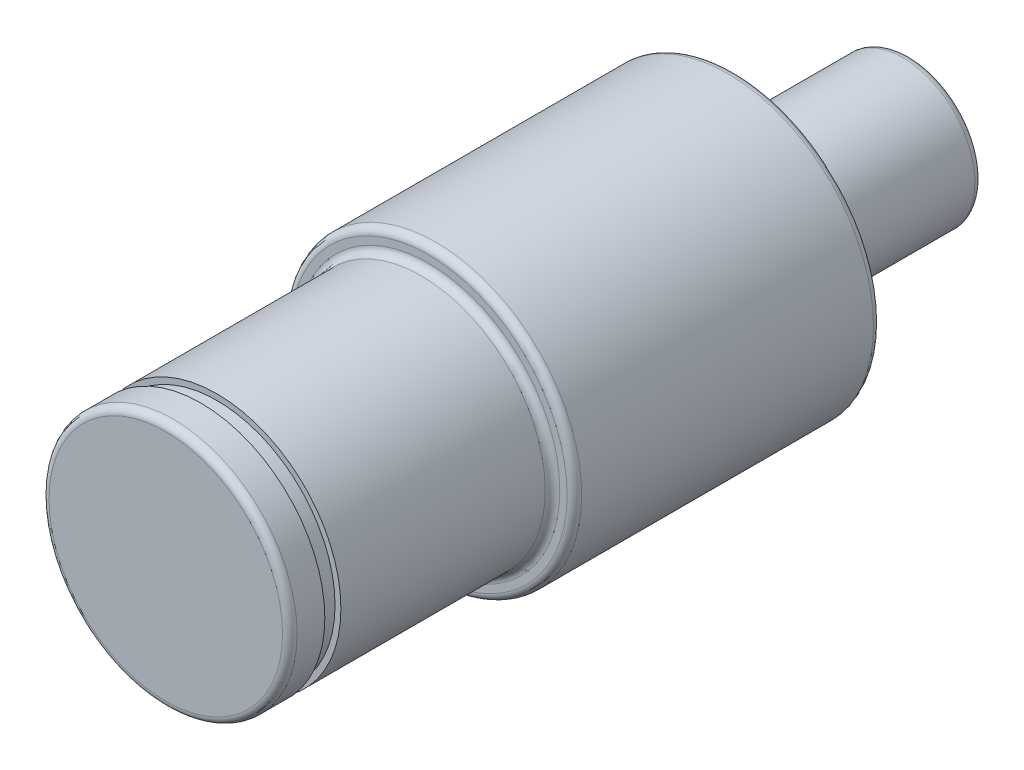
ISO-10303-21;
HEADER;
FILE_DESCRIPTION(('STEP AP214'),'2;1');
FILE_NAME('part.step','',(''),(''),'','','');
FILE_SCHEMA(('AUTOMOTIVE_DESIGN { 1 0 10303 214 1 1 1 1 }'));
ENDSEC;
DATA;
#1=APPLICATION_CONTEXT('core data for automotive mechanical design processes');
#2=APPLICATION_PROTOCOL_DEFINITION('international standard','automotive_design',2000,#1);
#3=PRODUCT_CONTEXT('',#1,'mechanical');
#4=PRODUCT('Part','Part','',(#3));
#5=PRODUCT_RELATED_PRODUCT_CATEGORY('part','',(#4));
#6=PRODUCT_DEFINITION_FORMATION('','',#4);
#7=PRODUCT_DEFINITION_CONTEXT('part definition',#1,'design');
#8=PRODUCT_DEFINITION('design','',#6,#7);
#9=PRODUCT_DEFINITION_SHAPE('','',#8);
#10=(LENGTH_UNIT() NAMED_UNIT(*) SI_UNIT(.MILLI.,.METRE.));
#11=(NAMED_UNIT(*) PLANE_ANGLE_UNIT() SI_UNIT($,.RADIAN.));
#12=(NAMED_UNIT(*) SI_UNIT($,.STERADIAN.) SOLID_ANGLE_UNIT());
#13=UNCERTAINTY_MEASURE_WITH_UNIT(LENGTH_MEASURE(1.E-05),#10,'distance_accuracy_value','');
#14=(GEOMETRIC_REPRESENTATION_CONTEXT(3) GLOBAL_UNCERTAINTY_ASSIGNED_CONTEXT((#13)) GLOBAL_UNIT_ASSIGNED_CONTEXT((#10,
#11,#12)) REPRESENTATION_CONTEXT('',''));
#15=CARTESIAN_POINT('',(0.,0.,0.));
#16=DIRECTION('',(0.,0.,1.));
#17=DIRECTION('',(1.,0.,0.));
#18=AXIS2_PLACEMENT_3D('',#15,#16,#17);
#19=CARTESIAN_POINT('',(0.,0.,39.));
#20=DIRECTION('',(0.,0.,-1.));
#21=DIRECTION('',(-1.,0.,0.));
#22=AXIS2_PLACEMENT_3D('',#19,#20,#21);
#23=CYLINDRICAL_SURFACE('',#22,8.5);
#24=CARTESIAN_POINT('',(0.,0.,21.5));
#25=DIRECTION('',(0.,0.,1.));
#26=DIRECTION('',(1.,0.,0.));
#27=AXIS2_PLACEMENT_3D('',#24,#25,#26);
#28=CIRCLE('',#27,8.5);
#29=CARTESIAN_POINT('',(8.5,0.,21.5));
#30=VERTEX_POINT('',#29);
#31=EDGE_CURVE('E55',#30,#30,#28,.T.);
#32=ORIENTED_EDGE('',*,*,#31,.T.);
#33=EDGE_LOOP('',(#32));
#34=FACE_BOUND('',#33,.T.);
#35=CARTESIAN_POINT('',(0.,0.,35.5));
#36=DIRECTION('',(0.,0.,1.));
#37=DIRECTION('',(1.,0.,0.));
#38=AXIS2_PLACEMENT_3D('',#35,#36,#37);
#39=CIRCLE('',#38,8.5);
#40=CARTESIAN_POINT('',(8.5,0.,35.5));
#41=VERTEX_POINT('',#40);
#42=EDGE_CURVE('E49',#41,#41,#39,.T.);
#43=ORIENTED_EDGE('',*,*,#42,.F.);
#44=EDGE_LOOP('',(#43));
#45=FACE_BOUND('',#44,.T.);
#46=ADVANCED_FACE('F33',(#34,#45),#23,.T.);
#47=CARTESIAN_POINT('',(0.,0.,21.));
#48=DIRECTION('',(0.,0.,-1.));
#49=DIRECTION('',(-1.,0.,0.));
#50=AXIS2_PLACEMENT_3D('',#47,#48,#49);
#51=CYLINDRICAL_SURFACE('',#50,10.);
#52=CARTESIAN_POINT('',(0.,0.,0.5));
#53=DIRECTION('',(0.,0.,1.));
#54=DIRECTION('',(1.,0.,0.));
#55=AXIS2_PLACEMENT_3D('',#52,#53,#54);
#56=CIRCLE('',#55,10.);
#57=CARTESIAN_POINT('',(10.,0.,0.5));
#58=VERTEX_POINT('',#57);
#59=EDGE_CURVE('E78',#58,#58,#56,.T.);
#60=ORIENTED_EDGE('',*,*,#59,.T.);
#61=EDGE_LOOP('',(#60));
#62=FACE_BOUND('',#61,.T.);
#63=CARTESIAN_POINT('',(0.,0.,20.5));
#64=DIRECTION('',(0.,0.,1.));
#65=DIRECTION('',(1.,0.,0.));
#66=AXIS2_PLACEMENT_3D('',#63,#64,#65);
#67=CIRCLE('',#66,10.);
#68=CARTESIAN_POINT('',(10.,0.,20.5));
#69=VERTEX_POINT('',#68);
#70=EDGE_CURVE('E75',#69,#69,#67,.F.);
#71=ORIENTED_EDGE('',*,*,#70,.T.);
#72=EDGE_LOOP('',(#71));
#73=FACE_BOUND('',#72,.T.);
#74=ADVANCED_FACE('F112',(#62,#73),#51,.T.);
#75=CARTESIAN_POINT('',(0.,0.,21.));
#76=DIRECTION('',(0.,0.,1.));
#77=DIRECTION('',(1.,0.,0.));
#78=AXIS2_PLACEMENT_3D('',#75,#76,#77);
#79=PLANE('',#78);
#80=CARTESIAN_POINT('',(0.,0.,21.));
#81=DIRECTION('',(0.,0.,1.));
#82=DIRECTION('',(1.,0.,0.));
#83=AXIS2_PLACEMENT_3D('',#80,#81,#82);
#84=CIRCLE('',#83,9.5);
#85=CARTESIAN_POINT('',(9.5,0.,21.));
#86=VERTEX_POINT('',#85);
#87=EDGE_CURVE('E84',#86,#86,#84,.T.);
#88=ORIENTED_EDGE('',*,*,#87,.T.);
#89=EDGE_LOOP('',(#88));
#90=FACE_BOUND('',#89,.T.);
#91=CARTESIAN_POINT('',(0.,0.,21.));
#92=DIRECTION('',(0.,0.,1.));
#93=DIRECTION('',(1.,0.,0.));
#94=AXIS2_PLACEMENT_3D('',#91,#92,#93);
#95=CIRCLE('',#94,9.);
#96=CARTESIAN_POINT('',(9.,0.,21.));
#97=VERTEX_POINT('',#96);
#98=EDGE_CURVE('E66',#97,#97,#95,.F.);
#99=ORIENTED_EDGE('',*,*,#98,.T.);
#100=EDGE_LOOP('',(#99));
#101=FACE_BOUND('',#100,.T.);
#102=ADVANCED_FACE('F117',(#90,#101),#79,.T.);
#103=CARTESIAN_POINT('',(0.,0.,0.));
#104=DIRECTION('',(0.,0.,1.));
#105=DIRECTION('',(1.,0.,0.));
#106=AXIS2_PLACEMENT_3D('',#103,#104,#105);
#107=PLANE('',#106);
#108=CARTESIAN_POINT('',(0.,0.,0.));
#109=DIRECTION('',(0.,0.,1.));
#110=DIRECTION('',(1.,0.,0.));
#111=AXIS2_PLACEMENT_3D('',#108,#109,#110);
#112=CIRCLE('',#111,9.5);
#113=CARTESIAN_POINT('',(9.5,0.,0.));
#114=VERTEX_POINT('',#113);
#115=EDGE_CURVE('E81',#114,#114,#112,.F.);
#116=ORIENTED_EDGE('',*,*,#115,.T.);
#117=EDGE_LOOP('',(#116));
#118=FACE_BOUND('',#117,.T.);
#119=CARTESIAN_POINT('',(0.,0.,0.));
#120=DIRECTION('',(0.,0.,1.));
#121=DIRECTION('',(1.,0.,0.));
#122=AXIS2_PLACEMENT_3D('',#119,#120,#121);
#123=CIRCLE('',#122,5.45);
#124=CARTESIAN_POINT('',(5.45,0.,0.));
#125=VERTEX_POINT('',#124);
#126=EDGE_CURVE('E72',#125,#125,#123,.T.);
#127=ORIENTED_EDGE('',*,*,#126,.T.);
#128=EDGE_LOOP('',(#127));
#129=FACE_BOUND('',#128,.T.);
#130=ADVANCED_FACE('F146',(#118,#129),#107,.F.);
#131=CARTESIAN_POINT('',(0.,0.,-12.));
#132=DIRECTION('',(0.,0.,1.));
#133=DIRECTION('',(1.,0.,0.));
#134=AXIS2_PLACEMENT_3D('',#131,#132,#133);
#135=CYLINDRICAL_SURFACE('',#134,4.95);
#136=CARTESIAN_POINT('',(0.,0.,-11.5));
#137=DIRECTION('',(0.,0.,-1.));
#138=DIRECTION('',(-1.,0.,0.));
#139=AXIS2_PLACEMENT_3D('',#136,#137,#138);
#140=CIRCLE('',#139,4.95);
#141=CARTESIAN_POINT('',(-4.95,0.,-11.5));
#142=VERTEX_POINT('',#141);
#143=EDGE_CURVE('E11',#142,#142,#140,.F.);
#144=ORIENTED_EDGE('',*,*,#143,.T.);
#145=EDGE_LOOP('',(#144));
#146=FACE_BOUND('',#145,.T.);
#147=CARTESIAN_POINT('',(0.,0.,-0.5));
#148=DIRECTION('',(0.,0.,1.));
#149=DIRECTION('',(1.,0.,0.));
#150=AXIS2_PLACEMENT_3D('',#147,#148,#149);
#151=CIRCLE('',#150,4.95);
#152=CARTESIAN_POINT('',(4.95,0.,-0.5));
#153=VERTEX_POINT('',#152);
#154=EDGE_CURVE('E69',#153,#153,#151,.F.);
#155=ORIENTED_EDGE('',*,*,#154,.T.);
#156=EDGE_LOOP('',(#155));
#157=FACE_BOUND('',#156,.T.);
#158=ADVANCED_FACE('F143',(#146,#157),#135,.T.);
#159=CARTESIAN_POINT('',(0.,0.,-12.));
#160=DIRECTION('',(0.,0.,-1.));
#161=DIRECTION('',(-1.,0.,0.));
#162=AXIS2_PLACEMENT_3D('',#159,#160,#161);
#163=PLANE('',#162);
#164=CARTESIAN_POINT('',(0.,0.,-12.));
#165=DIRECTION('',(0.,0.,-1.));
#166=DIRECTION('',(-1.,0.,0.));
#167=AXIS2_PLACEMENT_3D('',#164,#165,#166);
#168=CIRCLE('',#167,4.45);
#169=CARTESIAN_POINT('',(-4.45,0.,-12.));
#170=VERTEX_POINT('',#169);
#171=EDGE_CURVE('E41',#170,#170,#168,.T.);
#172=ORIENTED_EDGE('',*,*,#171,.T.);
#173=EDGE_LOOP('',(#172));
#174=FACE_BOUND('',#173,.T.);
#175=ADVANCED_FACE('F140',(#174),#163,.T.);
#176=CARTESIAN_POINT('',(0.,0.,21.5));
#177=DIRECTION('',(0.,0.,1.));
#178=DIRECTION('',(1.,0.,0.));
#179=AXIS2_PLACEMENT_3D('',#176,#177,#178);
#180=TOROIDAL_SURFACE('',#179,9.,0.5);
#181=ORIENTED_EDGE('',*,*,#98,.F.);
#182=EDGE_LOOP('',(#181));
#183=FACE_BOUND('',#182,.T.);
#184=ORIENTED_EDGE('',*,*,#31,.F.);
#185=EDGE_LOOP('',(#184));
#186=FACE_BOUND('',#185,.T.);
#187=ADVANCED_FACE('F142',(#183,#186),#180,.F.);
#188=CARTESIAN_POINT('',(0.,0.,-0.5));
#189=DIRECTION('',(0.,0.,1.));
#190=DIRECTION('',(1.,0.,0.));
#191=AXIS2_PLACEMENT_3D('',#188,#189,#190);
#192=TOROIDAL_SURFACE('',#191,5.45,0.5);
#193=ORIENTED_EDGE('',*,*,#126,.F.);
#194=EDGE_LOOP('',(#193));
#195=FACE_BOUND('',#194,.T.);
#196=ORIENTED_EDGE('',*,*,#154,.F.);
#197=EDGE_LOOP('',(#196));
#198=FACE_BOUND('',#197,.T.);
#199=ADVANCED_FACE('F155',(#195,#198),#192,.F.);
#200=CARTESIAN_POINT('',(0.,0.,0.5));
#201=DIRECTION('',(0.,0.,1.));
#202=DIRECTION('',(1.,0.,0.));
#203=AXIS2_PLACEMENT_3D('',#200,#201,#202);
#204=TOROIDAL_SURFACE('',#203,9.5,0.5);
#205=ORIENTED_EDGE('',*,*,#115,.F.);
#206=EDGE_LOOP('',(#205));
#207=FACE_BOUND('',#206,.T.);
#208=ORIENTED_EDGE('',*,*,#59,.F.);
#209=EDGE_LOOP('',(#208));
#210=FACE_BOUND('',#209,.T.);
#211=ADVANCED_FACE('F157',(#207,#210),#204,.T.);
#212=CARTESIAN_POINT('',(0.,0.,20.5));
#213=DIRECTION('',(0.,0.,1.));
#214=DIRECTION('',(1.,0.,0.));
#215=AXIS2_PLACEMENT_3D('',#212,#213,#214);
#216=TOROIDAL_SURFACE('',#215,9.5,0.5);
#217=ORIENTED_EDGE('',*,*,#70,.F.);
#218=EDGE_LOOP('',(#217));
#219=FACE_BOUND('',#218,.T.);
#220=ORIENTED_EDGE('',*,*,#87,.F.);
#221=EDGE_LOOP('',(#220));
#222=FACE_BOUND('',#221,.T.);
#223=ADVANCED_FACE('F137',(#219,#222),#216,.T.);
#224=CARTESIAN_POINT('',(0.,0.,-11.5));
#225=DIRECTION('',(0.,0.,-1.));
#226=DIRECTION('',(-1.,0.,0.));
#227=AXIS2_PLACEMENT_3D('',#224,#225,#226);
#228=TOROIDAL_SURFACE('',#227,4.45,0.5);
#229=ORIENTED_EDGE('',*,*,#143,.F.);
#230=EDGE_LOOP('',(#229));
#231=FACE_BOUND('',#230,.T.);
#232=ORIENTED_EDGE('',*,*,#171,.F.);
#233=EDGE_LOOP('',(#232));
#234=FACE_BOUND('',#233,.T.);
#235=ADVANCED_FACE('F35',(#231,#234),#228,.T.);
#236=CARTESIAN_POINT('',(0.,0.,36.6));
#237=DIRECTION('',(0.,0.,1.));
#238=DIRECTION('',(1.,0.,0.));
#239=AXIS2_PLACEMENT_3D('',#236,#237,#238);
#240=PLANE('',#239);
#241=CARTESIAN_POINT('',(0.,0.,36.6));
#242=DIRECTION('',(0.,0.,1.));
#243=DIRECTION('',(1.,0.,0.));
#244=AXIS2_PLACEMENT_3D('',#241,#242,#243);
#245=CIRCLE('',#244,8.1);
#246=CARTESIAN_POINT('',(8.1,0.,36.6));
#247=VERTEX_POINT('',#246);
#248=EDGE_CURVE('E51',#247,#247,#245,.T.);
#249=ORIENTED_EDGE('',*,*,#248,.T.);
#250=EDGE_LOOP('',(#249));
#251=FACE_BOUND('',#250,.T.);
#252=CARTESIAN_POINT('',(0.,0.,36.6));
#253=DIRECTION('',(0.,0.,1.));
#254=DIRECTION('',(1.,0.,0.));
#255=AXIS2_PLACEMENT_3D('',#252,#253,#254);
#256=CIRCLE('',#255,8.5);
#257=CARTESIAN_POINT('',(8.5,0.,36.6));
#258=VERTEX_POINT('',#257);
#259=EDGE_CURVE('E37',#258,#258,#256,.T.);
#260=ORIENTED_EDGE('',*,*,#259,.F.);
#261=EDGE_LOOP('',(#260));
#262=FACE_BOUND('',#261,.T.);
#263=ADVANCED_FACE('F128',(#251,#262),#240,.F.);
#264=CARTESIAN_POINT('',(0.,0.,35.5));
#265=DIRECTION('',(0.,0.,1.));
#266=DIRECTION('',(1.,0.,0.));
#267=AXIS2_PLACEMENT_3D('',#264,#265,#266);
#268=PLANE('',#267);
#269=CARTESIAN_POINT('',(0.,0.,35.5));
#270=DIRECTION('',(0.,0.,1.));
#271=DIRECTION('',(1.,0.,0.));
#272=AXIS2_PLACEMENT_3D('',#269,#270,#271);
#273=CIRCLE('',#272,8.1);
#274=CARTESIAN_POINT('',(8.1,0.,35.5));
#275=VERTEX_POINT('',#274);
#276=EDGE_CURVE('E57',#275,#275,#273,.T.);
#277=ORIENTED_EDGE('',*,*,#276,.F.);
#278=EDGE_LOOP('',(#277));
#279=FACE_BOUND('',#278,.T.);
#280=ORIENTED_EDGE('',*,*,#42,.T.);
#281=EDGE_LOOP('',(#280));
#282=FACE_BOUND('',#281,.T.);
#283=ADVANCED_FACE('F106',(#279,#282),#268,.T.);
#284=CARTESIAN_POINT('',(0.,0.,36.6));
#285=DIRECTION('',(0.,0.,-1.));
#286=DIRECTION('',(-1.,0.,0.));
#287=AXIS2_PLACEMENT_3D('',#284,#285,#286);
#288=CYLINDRICAL_SURFACE('',#287,8.1);
#289=ORIENTED_EDGE('',*,*,#248,.F.);
#290=EDGE_LOOP('',(#289));
#291=FACE_BOUND('',#290,.T.);
#292=ORIENTED_EDGE('',*,*,#276,.T.);
#293=EDGE_LOOP('',(#292));
#294=FACE_BOUND('',#293,.T.);
#295=ADVANCED_FACE('F101',(#291,#294),#288,.T.);
#296=CARTESIAN_POINT('',(0.,0.,39.));
#297=DIRECTION('',(0.,0.,1.));
#298=DIRECTION('',(1.,0.,0.));
#299=AXIS2_PLACEMENT_3D('',#296,#297,#298);
#300=PLANE('',#299);
#301=CARTESIAN_POINT('',(0.,0.,39.));
#302=DIRECTION('',(0.,0.,1.));
#303=DIRECTION('',(1.,0.,0.));
#304=AXIS2_PLACEMENT_3D('',#301,#302,#303);
#305=CIRCLE('',#304,8.);
#306=CARTESIAN_POINT('',(8.,0.,39.));
#307=VERTEX_POINT('',#306);
#308=EDGE_CURVE('E87',#307,#307,#305,.T.);
#309=ORIENTED_EDGE('',*,*,#308,.T.);
#310=EDGE_LOOP('',(#309));
#311=FACE_BOUND('',#310,.T.);
#312=ADVANCED_FACE('F97',(#311),#300,.T.);
#313=CARTESIAN_POINT('',(0.,0.,38.5));
#314=DIRECTION('',(0.,0.,1.));
#315=DIRECTION('',(1.,0.,0.));
#316=AXIS2_PLACEMENT_3D('',#313,#314,#315);
#317=TOROIDAL_SURFACE('',#316,8.,0.5);
#318=CARTESIAN_POINT('',(0.,0.,38.5));
#319=DIRECTION('',(0.,0.,1.));
#320=DIRECTION('',(1.,0.,0.));
#321=AXIS2_PLACEMENT_3D('',#318,#319,#320);
#322=CIRCLE('',#321,8.5);
#323=CARTESIAN_POINT('',(8.5,0.,38.5));
#324=VERTEX_POINT('',#323);
#325=EDGE_CURVE('E46',#324,#324,#322,.F.);
#326=ORIENTED_EDGE('',*,*,#325,.F.);
#327=EDGE_LOOP('',(#326));
#328=FACE_BOUND('',#327,.T.);
#329=ORIENTED_EDGE('',*,*,#308,.F.);
#330=EDGE_LOOP('',(#329));
#331=FACE_BOUND('',#330,.T.);
#332=ADVANCED_FACE('F94',(#328,#331),#317,.T.);
#333=ORIENTED_EDGE('',*,*,#259,.T.);
#334=EDGE_LOOP('',(#333));
#335=FACE_BOUND('',#334,.T.);
#336=ORIENTED_EDGE('',*,*,#325,.T.);
#337=EDGE_LOOP('',(#336));
#338=FACE_BOUND('',#337,.T.);
#339=ADVANCED_FACE('F92',(#335,#338),#23,.T.);
#340=CLOSED_SHELL('',(#46,#74,#102,#130,#158,#175,#187,#199,#211,#223,#235,#263,#283,#295,#312,
#332,#339));
#341=MANIFOLD_SOLID_BREP('B2',#340);
#342=ADVANCED_BREP_SHAPE_REPRESENTATION('',(#18,#341),#14);
#343=SHAPE_DEFINITION_REPRESENTATION(#9,#342);
ENDSEC;
END-ISO-10303-21;
